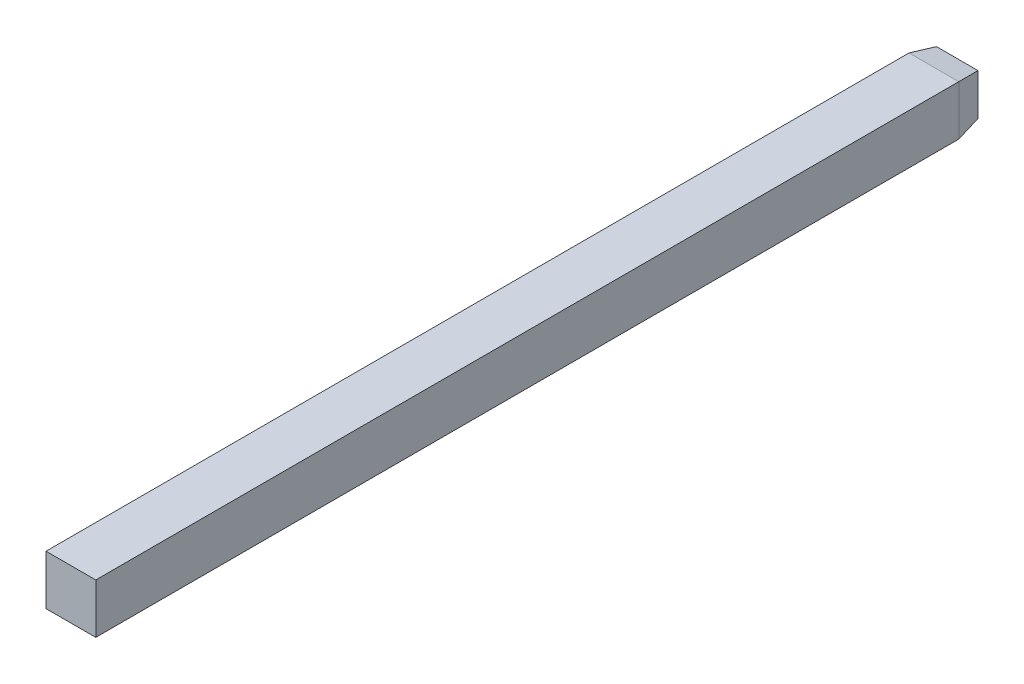
ISO-10303-21;
HEADER;
FILE_DESCRIPTION(('STEP AP214'),'2;1');
FILE_NAME('part.step','',(''),(''),'','','');
FILE_SCHEMA(('AUTOMOTIVE_DESIGN { 1 0 10303 214 1 1 1 1 }'));
ENDSEC;
DATA;
#1=APPLICATION_CONTEXT('core data for automotive mechanical design processes');
#2=APPLICATION_PROTOCOL_DEFINITION('international standard','automotive_design',2000,#1);
#3=PRODUCT_CONTEXT('',#1,'mechanical');
#4=PRODUCT('Part','Part','',(#3));
#5=PRODUCT_RELATED_PRODUCT_CATEGORY('part','',(#4));
#6=PRODUCT_DEFINITION_FORMATION('','',#4);
#7=PRODUCT_DEFINITION_CONTEXT('part definition',#1,'design');
#8=PRODUCT_DEFINITION('design','',#6,#7);
#9=PRODUCT_DEFINITION_SHAPE('','',#8);
#10=(LENGTH_UNIT() NAMED_UNIT(*) SI_UNIT(.MILLI.,.METRE.));
#11=(NAMED_UNIT(*) PLANE_ANGLE_UNIT() SI_UNIT($,.RADIAN.));
#12=(NAMED_UNIT(*) SI_UNIT($,.STERADIAN.) SOLID_ANGLE_UNIT());
#13=UNCERTAINTY_MEASURE_WITH_UNIT(LENGTH_MEASURE(1.E-05),#10,'distance_accuracy_value','');
#14=(GEOMETRIC_REPRESENTATION_CONTEXT(3) GLOBAL_UNCERTAINTY_ASSIGNED_CONTEXT((#13)) GLOBAL_UNIT_ASSIGNED_CONTEXT((#10,
#11,#12)) REPRESENTATION_CONTEXT('',''));
#15=CARTESIAN_POINT('',(0.,0.,0.));
#16=DIRECTION('',(0.,0.,1.));
#17=DIRECTION('',(1.,0.,0.));
#18=AXIS2_PLACEMENT_3D('',#15,#16,#17);
#19=CARTESIAN_POINT('',(0.32,-0.32,0.300000000000005));
#20=DIRECTION('',(0.,-0.984807753012209,-0.173648177666927));
#21=DIRECTION('',(0.,0.173648177666927,-0.984807753012209));
#22=AXIS2_PLACEMENT_3D('',#19,#20,#21);
#23=PLANE('',#22);
#24=DIRECTION('',(0.171087869746032,0.171087869746032,-0.970287525247815));
#25=VECTOR('',#24,1.);
#26=CARTESIAN_POINT('',(-0.301266522128489,-0.301266522128488,0.193757167529094));
#27=LINE('',#26,#25);
#28=CARTESIAN_POINT('',(-0.32,-0.32,0.300000000000005));
#29=VERTEX_POINT('',#28);
#30=CARTESIAN_POINT('',(-0.267101905787461,-0.267101905787459,0.));
#31=VERTEX_POINT('',#30);
#32=EDGE_CURVE('E26',#29,#31,#27,.T.);
#33=ORIENTED_EDGE('',*,*,#32,.T.);
#34=DIRECTION('',(-1.,0.,0.));
#35=VECTOR('',#34,1.);
#36=CARTESIAN_POINT('',(-0.32,-0.267101905787459,0.));
#37=LINE('',#36,#35);
#38=CARTESIAN_POINT('',(0.267101905787461,-0.267101905787459,0.));
#39=VERTEX_POINT('',#38);
#40=EDGE_CURVE('E165',#39,#31,#37,.T.);
#41=ORIENTED_EDGE('',*,*,#40,.F.);
#42=DIRECTION('',(0.171087869746032,-0.171087869746032,0.970287525247815));
#43=VECTOR('',#42,1.);
#44=CARTESIAN_POINT('',(0.301266522128489,-0.301266522128488,0.193757167529094));
#45=LINE('',#44,#43);
#46=CARTESIAN_POINT('',(0.32,-0.32,0.300000000000005));
#47=VERTEX_POINT('',#46);
#48=EDGE_CURVE('E11',#39,#47,#45,.T.);
#49=ORIENTED_EDGE('',*,*,#48,.T.);
#50=DIRECTION('',(1.,0.,0.));
#51=VECTOR('',#50,1.);
#52=CARTESIAN_POINT('',(0.32,-0.32,0.300000000000005));
#53=LINE('',#52,#51);
#54=EDGE_CURVE('E94',#29,#47,#53,.T.);
#55=ORIENTED_EDGE('',*,*,#54,.F.);
#56=EDGE_LOOP('',(#33,#41,#49,#55));
#57=FACE_BOUND('',#56,.T.);
#58=ADVANCED_FACE('F16',(#57),#23,.T.);
#59=CARTESIAN_POINT('',(0.32,0.32,0.300000000000005));
#60=DIRECTION('',(0.984807753012209,0.,-0.173648177666927));
#61=DIRECTION('',(0.,-1.,0.));
#62=AXIS2_PLACEMENT_3D('',#59,#60,#61);
#63=PLANE('',#62);
#64=DIRECTION('',(0.171087869746032,0.171087869746032,0.970287525247815));
#65=VECTOR('',#64,1.);
#66=CARTESIAN_POINT('',(0.32,0.32,0.300000000000005));
#67=LINE('',#66,#65);
#68=CARTESIAN_POINT('',(0.267101905787461,0.267101905787463,0.));
#69=VERTEX_POINT('',#68);
#70=CARTESIAN_POINT('',(0.32,0.32,0.300000000000005));
#71=VERTEX_POINT('',#70);
#72=EDGE_CURVE('E139',#69,#71,#67,.T.);
#73=ORIENTED_EDGE('',*,*,#72,.T.);
#74=DIRECTION('',(0.,1.,0.));
#75=VECTOR('',#74,1.);
#76=CARTESIAN_POINT('',(0.32,0.32,0.300000000000005));
#77=LINE('',#76,#75);
#78=EDGE_CURVE('E156',#47,#71,#77,.T.);
#79=ORIENTED_EDGE('',*,*,#78,.F.);
#80=ORIENTED_EDGE('',*,*,#48,.F.);
#81=DIRECTION('',(0.,-1.,0.));
#82=VECTOR('',#81,1.);
#83=CARTESIAN_POINT('',(0.267101905787461,-0.32,0.));
#84=LINE('',#83,#82);
#85=EDGE_CURVE('E133',#69,#39,#84,.T.);
#86=ORIENTED_EDGE('',*,*,#85,.F.);
#87=EDGE_LOOP('',(#73,#79,#80,#86));
#88=FACE_BOUND('',#87,.T.);
#89=ADVANCED_FACE('F181',(#88),#63,.T.);
#90=CARTESIAN_POINT('',(-0.32,0.32,0.300000000000005));
#91=DIRECTION('',(-0.984807753012209,0.,-0.173648177666927));
#92=DIRECTION('',(-0.173648177666927,0.,0.984807753012209));
#93=AXIS2_PLACEMENT_3D('',#90,#91,#92);
#94=PLANE('',#93);
#95=DIRECTION('',(0.171087869746032,-0.171087869746032,-0.970287525247815));
#96=VECTOR('',#95,1.);
#97=CARTESIAN_POINT('',(-0.32,0.32,0.300000000000005));
#98=LINE('',#97,#96);
#99=CARTESIAN_POINT('',(-0.32,0.32,0.300000000000005));
#100=VERTEX_POINT('',#99);
#101=CARTESIAN_POINT('',(-0.267101905787461,0.267101905787463,0.));
#102=VERTEX_POINT('',#101);
#103=EDGE_CURVE('E40',#100,#102,#98,.T.);
#104=ORIENTED_EDGE('',*,*,#103,.T.);
#105=DIRECTION('',(0.,1.,0.));
#106=VECTOR('',#105,1.);
#107=CARTESIAN_POINT('',(-0.267101905787461,0.32,0.));
#108=LINE('',#107,#106);
#109=EDGE_CURVE('E87',#31,#102,#108,.T.);
#110=ORIENTED_EDGE('',*,*,#109,.F.);
#111=ORIENTED_EDGE('',*,*,#32,.F.);
#112=DIRECTION('',(0.,-1.,0.));
#113=VECTOR('',#112,1.);
#114=CARTESIAN_POINT('',(-0.32,-0.32,0.300000000000005));
#115=LINE('',#114,#113);
#116=EDGE_CURVE('E19',#100,#29,#115,.T.);
#117=ORIENTED_EDGE('',*,*,#116,.F.);
#118=EDGE_LOOP('',(#104,#110,#111,#117));
#119=FACE_BOUND('',#118,.T.);
#120=ADVANCED_FACE('F83',(#119),#94,.T.);
#121=CARTESIAN_POINT('',(0.32,0.32,0.300000000000005));
#122=DIRECTION('',(0.,0.984807753012209,-0.173648177666927));
#123=DIRECTION('',(-1.,0.,0.));
#124=AXIS2_PLACEMENT_3D('',#121,#122,#123);
#125=PLANE('',#124);
#126=ORIENTED_EDGE('',*,*,#72,.F.);
#127=DIRECTION('',(1.,0.,0.));
#128=VECTOR('',#127,1.);
#129=CARTESIAN_POINT('',(0.32,0.267101905787463,0.));
#130=LINE('',#129,#128);
#131=EDGE_CURVE('E143',#102,#69,#130,.T.);
#132=ORIENTED_EDGE('',*,*,#131,.F.);
#133=ORIENTED_EDGE('',*,*,#103,.F.);
#134=DIRECTION('',(-1.,0.,0.));
#135=VECTOR('',#134,1.);
#136=CARTESIAN_POINT('',(-0.32,0.32,0.300000000000005));
#137=LINE('',#136,#135);
#138=EDGE_CURVE('E134',#71,#100,#137,.T.);
#139=ORIENTED_EDGE('',*,*,#138,.F.);
#140=EDGE_LOOP('',(#126,#132,#133,#139));
#141=FACE_BOUND('',#140,.T.);
#142=ADVANCED_FACE('F186',(#141),#125,.T.);
#143=CARTESIAN_POINT('',(-0.32,-0.32,0.));
#144=DIRECTION('',(0.,0.,-1.));
#145=DIRECTION('',(0.,-1.,0.));
#146=AXIS2_PLACEMENT_3D('',#143,#144,#145);
#147=PLANE('',#146);
#148=ORIENTED_EDGE('',*,*,#85,.T.);
#149=ORIENTED_EDGE('',*,*,#40,.T.);
#150=ORIENTED_EDGE('',*,*,#109,.T.);
#151=ORIENTED_EDGE('',*,*,#131,.T.);
#152=EDGE_LOOP('',(#148,#149,#150,#151));
#153=FACE_BOUND('',#152,.T.);
#154=ADVANCED_FACE('F184',(#153),#147,.T.);
#155=CARTESIAN_POINT('',(-0.32,-0.32,11.4));
#156=DIRECTION('',(0.,0.,-1.));
#157=DIRECTION('',(0.,-1.,0.));
#158=AXIS2_PLACEMENT_3D('',#155,#156,#157);
#159=PLANE('',#158);
#160=DIRECTION('',(0.,-1.,0.));
#161=VECTOR('',#160,1.);
#162=CARTESIAN_POINT('',(-0.32,0.32,11.4));
#163=LINE('',#162,#161);
#164=CARTESIAN_POINT('',(-0.32,0.32,11.4));
#165=VERTEX_POINT('',#164);
#166=CARTESIAN_POINT('',(-0.32,-0.32,11.4));
#167=VERTEX_POINT('',#166);
#168=EDGE_CURVE('E101',#165,#167,#163,.T.);
#169=ORIENTED_EDGE('',*,*,#168,.T.);
#170=DIRECTION('',(1.,0.,0.));
#171=VECTOR('',#170,1.);
#172=CARTESIAN_POINT('',(0.32,-0.32,11.4));
#173=LINE('',#172,#171);
#174=CARTESIAN_POINT('',(0.32,-0.32,11.4));
#175=VERTEX_POINT('',#174);
#176=EDGE_CURVE('E106',#167,#175,#173,.T.);
#177=ORIENTED_EDGE('',*,*,#176,.T.);
#178=DIRECTION('',(0.,1.,0.));
#179=VECTOR('',#178,1.);
#180=CARTESIAN_POINT('',(0.32,0.32,11.4));
#181=LINE('',#180,#179);
#182=CARTESIAN_POINT('',(0.32,0.32,11.4));
#183=VERTEX_POINT('',#182);
#184=EDGE_CURVE('E161',#175,#183,#181,.T.);
#185=ORIENTED_EDGE('',*,*,#184,.T.);
#186=DIRECTION('',(-1.,0.,0.));
#187=VECTOR('',#186,1.);
#188=CARTESIAN_POINT('',(0.32,0.32,11.4));
#189=LINE('',#188,#187);
#190=EDGE_CURVE('E130',#183,#165,#189,.T.);
#191=ORIENTED_EDGE('',*,*,#190,.T.);
#192=EDGE_LOOP('',(#169,#177,#185,#191));
#193=FACE_BOUND('',#192,.T.);
#194=ADVANCED_FACE('F193',(#193),#159,.F.);
#195=CARTESIAN_POINT('',(0.32,0.32,11.4));
#196=DIRECTION('',(0.,-1.,0.));
#197=DIRECTION('',(0.,0.,-1.));
#198=AXIS2_PLACEMENT_3D('',#195,#196,#197);
#199=PLANE('',#198);
#200=DIRECTION('',(0.,0.,-1.));
#201=VECTOR('',#200,1.);
#202=CARTESIAN_POINT('',(0.32,0.32,11.4));
#203=LINE('',#202,#201);
#204=EDGE_CURVE('E127',#183,#71,#203,.T.);
#205=ORIENTED_EDGE('',*,*,#204,.T.);
#206=ORIENTED_EDGE('',*,*,#138,.T.);
#207=DIRECTION('',(0.,0.,-1.));
#208=VECTOR('',#207,1.);
#209=CARTESIAN_POINT('',(-0.32,0.32,11.4));
#210=LINE('',#209,#208);
#211=EDGE_CURVE('E114',#165,#100,#210,.T.);
#212=ORIENTED_EDGE('',*,*,#211,.F.);
#213=ORIENTED_EDGE('',*,*,#190,.F.);
#214=EDGE_LOOP('',(#205,#206,#212,#213));
#215=FACE_BOUND('',#214,.T.);
#216=ADVANCED_FACE('F178',(#215),#199,.F.);
#217=CARTESIAN_POINT('',(0.32,0.32,11.4));
#218=DIRECTION('',(-1.,0.,0.));
#219=DIRECTION('',(0.,0.,1.));
#220=AXIS2_PLACEMENT_3D('',#217,#218,#219);
#221=PLANE('',#220);
#222=DIRECTION('',(0.,0.,-1.));
#223=VECTOR('',#222,1.);
#224=CARTESIAN_POINT('',(0.32,-0.32,11.4));
#225=LINE('',#224,#223);
#226=EDGE_CURVE('E100',#175,#47,#225,.T.);
#227=ORIENTED_EDGE('',*,*,#226,.T.);
#228=ORIENTED_EDGE('',*,*,#78,.T.);
#229=ORIENTED_EDGE('',*,*,#204,.F.);
#230=ORIENTED_EDGE('',*,*,#184,.F.);
#231=EDGE_LOOP('',(#227,#228,#229,#230));
#232=FACE_BOUND('',#231,.T.);
#233=ADVANCED_FACE('F180',(#232),#221,.F.);
#234=CARTESIAN_POINT('',(0.32,-0.32,11.4));
#235=DIRECTION('',(0.,1.,0.));
#236=DIRECTION('',(1.,0.,0.));
#237=AXIS2_PLACEMENT_3D('',#234,#235,#236);
#238=PLANE('',#237);
#239=DIRECTION('',(0.,0.,-1.));
#240=VECTOR('',#239,1.);
#241=CARTESIAN_POINT('',(-0.32,-0.32,11.4));
#242=LINE('',#241,#240);
#243=EDGE_CURVE('E103',#167,#29,#242,.T.);
#244=ORIENTED_EDGE('',*,*,#243,.T.);
#245=ORIENTED_EDGE('',*,*,#54,.T.);
#246=ORIENTED_EDGE('',*,*,#226,.F.);
#247=ORIENTED_EDGE('',*,*,#176,.F.);
#248=EDGE_LOOP('',(#244,#245,#246,#247));
#249=FACE_BOUND('',#248,.T.);
#250=ADVANCED_FACE('F104',(#249),#238,.F.);
#251=CARTESIAN_POINT('',(-0.32,0.32,11.4));
#252=DIRECTION('',(1.,0.,0.));
#253=DIRECTION('',(0.,1.,0.));
#254=AXIS2_PLACEMENT_3D('',#251,#252,#253);
#255=PLANE('',#254);
#256=ORIENTED_EDGE('',*,*,#211,.T.);
#257=ORIENTED_EDGE('',*,*,#116,.T.);
#258=ORIENTED_EDGE('',*,*,#243,.F.);
#259=ORIENTED_EDGE('',*,*,#168,.F.);
#260=EDGE_LOOP('',(#256,#257,#258,#259));
#261=FACE_BOUND('',#260,.T.);
#262=ADVANCED_FACE('F112',(#261),#255,.F.);
#263=CLOSED_SHELL('',(#58,#89,#120,#142,#154,#194,#216,#233,#250,#262));
#264=MANIFOLD_SOLID_BREP('B1',#263);
#265=ADVANCED_BREP_SHAPE_REPRESENTATION('',(#18,#264),#14);
#266=SHAPE_DEFINITION_REPRESENTATION(#9,#265);
ENDSEC;
END-ISO-10303-21;
